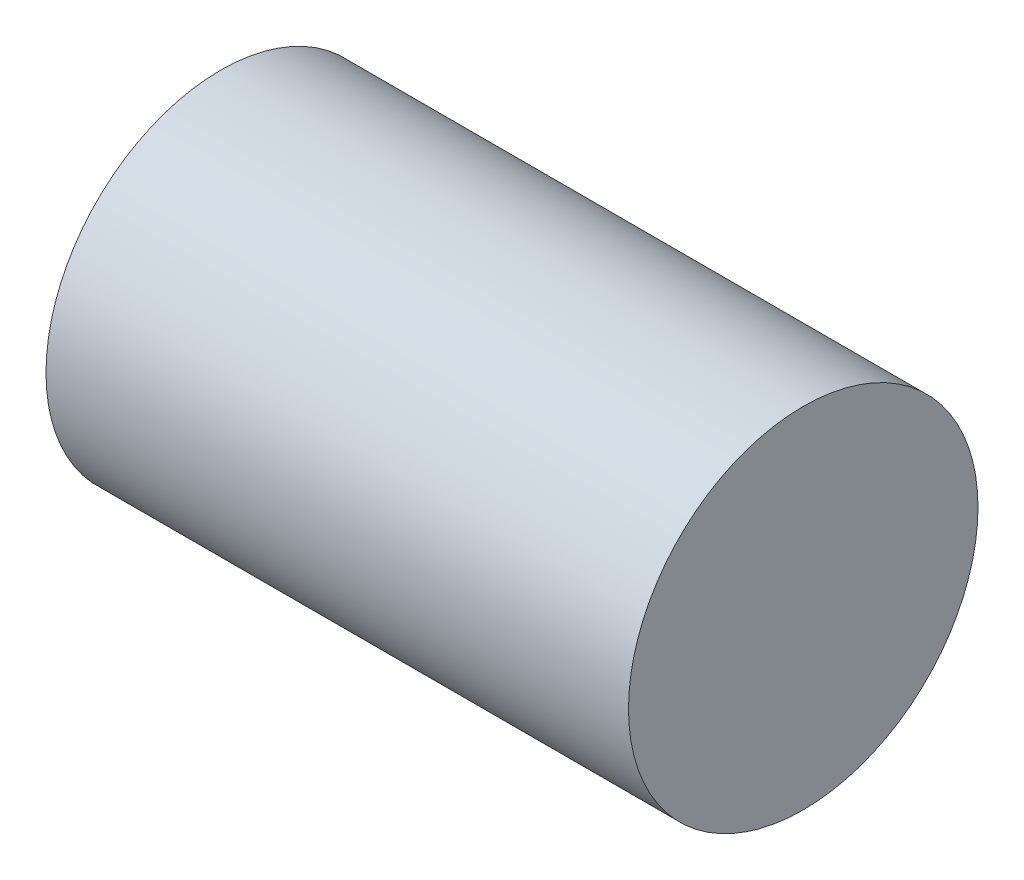
ISO-10303-21;
HEADER;
FILE_DESCRIPTION(('STEP AP214'),'2;1');
FILE_NAME('part.step','',(''),(''),'','','');
FILE_SCHEMA(('AUTOMOTIVE_DESIGN { 1 0 10303 214 1 1 1 1 }'));
ENDSEC;
DATA;
#1=APPLICATION_CONTEXT('core data for automotive mechanical design processes');
#2=APPLICATION_PROTOCOL_DEFINITION('international standard','automotive_design',2000,#1);
#3=PRODUCT_CONTEXT('',#1,'mechanical');
#4=PRODUCT('Part','Part','',(#3));
#5=PRODUCT_RELATED_PRODUCT_CATEGORY('part','',(#4));
#6=PRODUCT_DEFINITION_FORMATION('','',#4);
#7=PRODUCT_DEFINITION_CONTEXT('part definition',#1,'design');
#8=PRODUCT_DEFINITION('design','',#6,#7);
#9=PRODUCT_DEFINITION_SHAPE('','',#8);
#10=(LENGTH_UNIT() NAMED_UNIT(*) SI_UNIT(.MILLI.,.METRE.));
#11=(NAMED_UNIT(*) PLANE_ANGLE_UNIT() SI_UNIT($,.RADIAN.));
#12=(NAMED_UNIT(*) SI_UNIT($,.STERADIAN.) SOLID_ANGLE_UNIT());
#13=UNCERTAINTY_MEASURE_WITH_UNIT(LENGTH_MEASURE(1.E-05),#10,'distance_accuracy_value','');
#14=(GEOMETRIC_REPRESENTATION_CONTEXT(3) GLOBAL_UNCERTAINTY_ASSIGNED_CONTEXT((#13)) GLOBAL_UNIT_ASSIGNED_CONTEXT((#10,
#11,#12)) REPRESENTATION_CONTEXT('',''));
#15=CARTESIAN_POINT('',(0.,0.,0.));
#16=DIRECTION('',(0.,0.,1.));
#17=DIRECTION('',(1.,0.,0.));
#18=AXIS2_PLACEMENT_3D('',#15,#16,#17);
#19=CARTESIAN_POINT('',(0.,0.,0.));
#20=DIRECTION('',(-1.,0.,0.));
#21=DIRECTION('',(0.,0.,1.));
#22=AXIS2_PLACEMENT_3D('',#19,#20,#21);
#23=PLANE('',#22);
#24=CARTESIAN_POINT('',(0.,12.,0.));
#25=DIRECTION('',(-1.,0.,0.));
#26=DIRECTION('',(0.,0.,1.));
#27=AXIS2_PLACEMENT_3D('',#24,#25,#26);
#28=CIRCLE('',#27,12.);
#29=CARTESIAN_POINT('',(0.,12.,12.));
#30=VERTEX_POINT('',#29);
#31=EDGE_CURVE('E46',#30,#30,#28,.T.);
#32=ORIENTED_EDGE('',*,*,#31,.T.);
#33=EDGE_LOOP('',(#32));
#34=FACE_BOUND('',#33,.T.);
#35=ADVANCED_FACE('F39',(#34),#23,.T.);
#36=CARTESIAN_POINT('',(40.,0.,0.));
#37=DIRECTION('',(1.,0.,0.));
#38=DIRECTION('',(0.,0.,-1.));
#39=AXIS2_PLACEMENT_3D('',#36,#37,#38);
#40=PLANE('',#39);
#41=CARTESIAN_POINT('',(40.,12.,0.));
#42=DIRECTION('',(-1.,0.,0.));
#43=DIRECTION('',(0.,0.,1.));
#44=AXIS2_PLACEMENT_3D('',#41,#42,#43);
#45=CIRCLE('',#44,12.);
#46=CARTESIAN_POINT('',(40.,12.,12.));
#47=VERTEX_POINT('',#46);
#48=EDGE_CURVE('E10',#47,#47,#45,.T.);
#49=ORIENTED_EDGE('',*,*,#48,.F.);
#50=EDGE_LOOP('',(#49));
#51=FACE_BOUND('',#50,.T.);
#52=ADVANCED_FACE('F56',(#51),#40,.T.);
#53=CARTESIAN_POINT('',(0.,12.,0.));
#54=DIRECTION('',(-1.,0.,0.));
#55=DIRECTION('',(0.,0.,1.));
#56=AXIS2_PLACEMENT_3D('',#53,#54,#55);
#57=CYLINDRICAL_SURFACE('',#56,12.);
#58=ORIENTED_EDGE('',*,*,#48,.T.);
#59=EDGE_LOOP('',(#58));
#60=FACE_BOUND('',#59,.T.);
#61=ORIENTED_EDGE('',*,*,#31,.F.);
#62=EDGE_LOOP('',(#61));
#63=FACE_BOUND('',#62,.T.);
#64=ADVANCED_FACE('F54',(#60,#63),#57,.T.);
#65=CLOSED_SHELL('',(#35,#52,#64));
#66=MANIFOLD_SOLID_BREP('B2',#65);
#67=ADVANCED_BREP_SHAPE_REPRESENTATION('',(#18,#66),#14);
#68=SHAPE_DEFINITION_REPRESENTATION(#9,#67);
ENDSEC;
END-ISO-10303-21;
